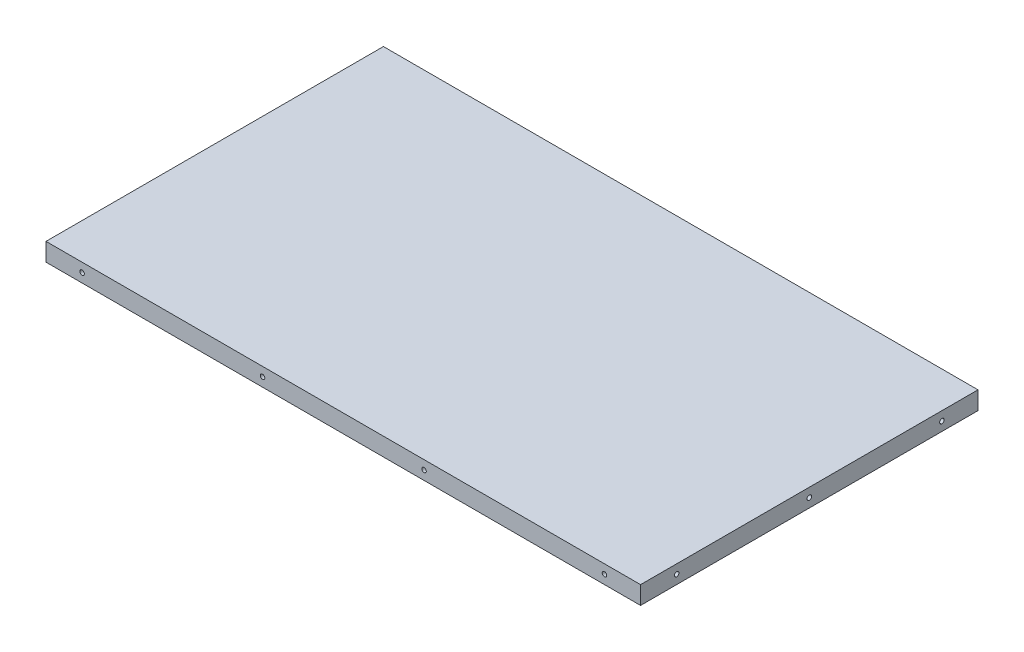
ISO-10303-21;
HEADER;
FILE_DESCRIPTION(('STEP AP214'),'2;1');
FILE_NAME('part.step','',(''),(''),'','','');
FILE_SCHEMA(('AUTOMOTIVE_DESIGN { 1 0 10303 214 1 1 1 1 }'));
ENDSEC;
DATA;
#1=APPLICATION_CONTEXT('core data for automotive mechanical design processes');
#2=APPLICATION_PROTOCOL_DEFINITION('international standard','automotive_design',2000,#1);
#3=PRODUCT_CONTEXT('',#1,'mechanical');
#4=PRODUCT('Part','Part','',(#3));
#5=PRODUCT_RELATED_PRODUCT_CATEGORY('part','',(#4));
#6=PRODUCT_DEFINITION_FORMATION('','',#4);
#7=PRODUCT_DEFINITION_CONTEXT('part definition',#1,'design');
#8=PRODUCT_DEFINITION('design','',#6,#7);
#9=PRODUCT_DEFINITION_SHAPE('','',#8);
#10=(LENGTH_UNIT() NAMED_UNIT(*) SI_UNIT(.MILLI.,.METRE.));
#11=(NAMED_UNIT(*) PLANE_ANGLE_UNIT() SI_UNIT($,.RADIAN.));
#12=(NAMED_UNIT(*) SI_UNIT($,.STERADIAN.) SOLID_ANGLE_UNIT());
#13=UNCERTAINTY_MEASURE_WITH_UNIT(LENGTH_MEASURE(1.E-05),#10,'distance_accuracy_value','');
#14=(GEOMETRIC_REPRESENTATION_CONTEXT(3) GLOBAL_UNCERTAINTY_ASSIGNED_CONTEXT((#13)) GLOBAL_UNIT_ASSIGNED_CONTEXT((#10,
#11,#12)) REPRESENTATION_CONTEXT('',''));
#15=CARTESIAN_POINT('',(0.,0.,0.));
#16=DIRECTION('',(0.,0.,1.));
#17=DIRECTION('',(1.,0.,0.));
#18=AXIS2_PLACEMENT_3D('',#15,#16,#17);
#19=CARTESIAN_POINT('',(0.,10.,0.));
#20=DIRECTION('',(1.,0.,0.));
#21=DIRECTION('',(0.,0.,-1.));
#22=AXIS2_PLACEMENT_3D('',#19,#20,#21);
#23=PLANE('',#22);
#24=CARTESIAN_POINT('',(0.,5.,-20.));
#25=DIRECTION('',(-1.,0.,0.));
#26=DIRECTION('',(0.,0.,1.));
#27=AXIS2_PLACEMENT_3D('',#24,#25,#26);
#28=CIRCLE('',#27,1.25);
#29=CARTESIAN_POINT('',(0.,5.,-18.75));
#30=VERTEX_POINT('',#29);
#31=EDGE_CURVE('E169',#30,#30,#28,.T.);
#32=ORIENTED_EDGE('',*,*,#31,.F.);
#33=EDGE_LOOP('',(#32));
#34=FACE_BOUND('',#33,.T.);
#35=CARTESIAN_POINT('',(0.,5.,-93.5));
#36=DIRECTION('',(-1.,0.,0.));
#37=DIRECTION('',(0.,0.,1.));
#38=AXIS2_PLACEMENT_3D('',#35,#36,#37);
#39=CIRCLE('',#38,1.25);
#40=CARTESIAN_POINT('',(0.,5.,-92.25));
#41=VERTEX_POINT('',#40);
#42=EDGE_CURVE('E163',#41,#41,#39,.T.);
#43=ORIENTED_EDGE('',*,*,#42,.F.);
#44=EDGE_LOOP('',(#43));
#45=FACE_BOUND('',#44,.T.);
#46=CARTESIAN_POINT('',(0.,5.,-167.));
#47=DIRECTION('',(-1.,0.,0.));
#48=DIRECTION('',(0.,0.,1.));
#49=AXIS2_PLACEMENT_3D('',#46,#47,#48);
#50=CIRCLE('',#49,1.25000000000001);
#51=CARTESIAN_POINT('',(0.,5.,-165.75));
#52=VERTEX_POINT('',#51);
#53=EDGE_CURVE('E157',#52,#52,#50,.T.);
#54=ORIENTED_EDGE('',*,*,#53,.F.);
#55=EDGE_LOOP('',(#54));
#56=FACE_BOUND('',#55,.T.);
#57=DIRECTION('',(0.,0.,1.));
#58=VECTOR('',#57,1.);
#59=CARTESIAN_POINT('',(0.,0.,0.));
#60=LINE('',#59,#58);
#61=CARTESIAN_POINT('',(0.,0.,-187.));
#62=VERTEX_POINT('',#61);
#63=CARTESIAN_POINT('',(0.,0.,0.));
#64=VERTEX_POINT('',#63);
#65=EDGE_CURVE('E95',#62,#64,#60,.T.);
#66=ORIENTED_EDGE('',*,*,#65,.T.);
#67=DIRECTION('',(0.,-1.,0.));
#68=VECTOR('',#67,1.);
#69=CARTESIAN_POINT('',(0.,10.,0.));
#70=LINE('',#69,#68);
#71=CARTESIAN_POINT('',(0.,10.,0.));
#72=VERTEX_POINT('',#71);
#73=EDGE_CURVE('E11',#72,#64,#70,.T.);
#74=ORIENTED_EDGE('',*,*,#73,.F.);
#75=DIRECTION('',(0.,0.,1.));
#76=VECTOR('',#75,1.);
#77=CARTESIAN_POINT('',(0.,10.,0.));
#78=LINE('',#77,#76);
#79=CARTESIAN_POINT('',(0.,10.,-187.));
#80=VERTEX_POINT('',#79);
#81=EDGE_CURVE('E83',#80,#72,#78,.T.);
#82=ORIENTED_EDGE('',*,*,#81,.F.);
#83=DIRECTION('',(0.,-1.,0.));
#84=VECTOR('',#83,1.);
#85=CARTESIAN_POINT('',(0.,10.,-187.));
#86=LINE('',#85,#84);
#87=EDGE_CURVE('E91',#80,#62,#86,.T.);
#88=ORIENTED_EDGE('',*,*,#87,.T.);
#89=EDGE_LOOP('',(#66,#74,#82,#88));
#90=FACE_BOUND('',#89,.T.);
#91=ADVANCED_FACE('F32',(#34,#45,#56,#90),#23,.F.);
#92=CARTESIAN_POINT('',(0.,10.,0.));
#93=DIRECTION('',(0.,0.,-1.));
#94=DIRECTION('',(-1.,0.,0.));
#95=AXIS2_PLACEMENT_3D('',#92,#93,#94);
#96=PLANE('',#95);
#97=CARTESIAN_POINT('',(309.5,5.,0.));
#98=DIRECTION('',(0.,0.,1.));
#99=DIRECTION('',(1.,0.,0.));
#100=AXIS2_PLACEMENT_3D('',#97,#98,#99);
#101=CIRCLE('',#100,1.24999999999996);
#102=CARTESIAN_POINT('',(310.75,5.,0.));
#103=VERTEX_POINT('',#102);
#104=EDGE_CURVE('E127',#103,#103,#101,.T.);
#105=ORIENTED_EDGE('',*,*,#104,.F.);
#106=EDGE_LOOP('',(#105));
#107=FACE_BOUND('',#106,.T.);
#108=CARTESIAN_POINT('',(209.5,5.,0.));
#109=DIRECTION('',(0.,0.,1.));
#110=DIRECTION('',(1.,0.,0.));
#111=AXIS2_PLACEMENT_3D('',#108,#109,#110);
#112=CIRCLE('',#111,1.25000000000001);
#113=CARTESIAN_POINT('',(210.75,5.,0.));
#114=VERTEX_POINT('',#113);
#115=EDGE_CURVE('E121',#114,#114,#112,.T.);
#116=ORIENTED_EDGE('',*,*,#115,.F.);
#117=EDGE_LOOP('',(#116));
#118=FACE_BOUND('',#117,.T.);
#119=CARTESIAN_POINT('',(120.,5.,0.));
#120=DIRECTION('',(0.,0.,1.));
#121=DIRECTION('',(1.,0.,0.));
#122=AXIS2_PLACEMENT_3D('',#119,#120,#121);
#123=CIRCLE('',#122,1.25);
#124=CARTESIAN_POINT('',(121.25,5.,0.));
#125=VERTEX_POINT('',#124);
#126=EDGE_CURVE('E115',#125,#125,#123,.T.);
#127=ORIENTED_EDGE('',*,*,#126,.F.);
#128=EDGE_LOOP('',(#127));
#129=FACE_BOUND('',#128,.T.);
#130=CARTESIAN_POINT('',(20.,5.,0.));
#131=DIRECTION('',(0.,0.,1.));
#132=DIRECTION('',(1.,0.,0.));
#133=AXIS2_PLACEMENT_3D('',#130,#131,#132);
#134=CIRCLE('',#133,1.25);
#135=CARTESIAN_POINT('',(21.25,5.,0.));
#136=VERTEX_POINT('',#135);
#137=EDGE_CURVE('E109',#136,#136,#134,.T.);
#138=ORIENTED_EDGE('',*,*,#137,.F.);
#139=EDGE_LOOP('',(#138));
#140=FACE_BOUND('',#139,.T.);
#141=DIRECTION('',(1.,0.,0.));
#142=VECTOR('',#141,1.);
#143=CARTESIAN_POINT('',(0.,0.,0.));
#144=LINE('',#143,#142);
#145=CARTESIAN_POINT('',(329.5,0.,0.));
#146=VERTEX_POINT('',#145);
#147=EDGE_CURVE('E87',#64,#146,#144,.T.);
#148=ORIENTED_EDGE('',*,*,#147,.T.);
#149=DIRECTION('',(0.,-1.,0.));
#150=VECTOR('',#149,1.);
#151=CARTESIAN_POINT('',(329.5,10.,0.));
#152=LINE('',#151,#150);
#153=CARTESIAN_POINT('',(329.5,10.,0.));
#154=VERTEX_POINT('',#153);
#155=EDGE_CURVE('E40',#154,#146,#152,.T.);
#156=ORIENTED_EDGE('',*,*,#155,.F.);
#157=DIRECTION('',(1.,0.,0.));
#158=VECTOR('',#157,1.);
#159=CARTESIAN_POINT('',(0.,10.,0.));
#160=LINE('',#159,#158);
#161=EDGE_CURVE('E78',#72,#154,#160,.T.);
#162=ORIENTED_EDGE('',*,*,#161,.F.);
#163=ORIENTED_EDGE('',*,*,#73,.T.);
#164=EDGE_LOOP('',(#148,#156,#162,#163));
#165=FACE_BOUND('',#164,.T.);
#166=ADVANCED_FACE('F86',(#107,#118,#129,#140,#165),#96,.F.);
#167=CARTESIAN_POINT('',(329.5,10.,0.));
#168=DIRECTION('',(-1.,0.,0.));
#169=DIRECTION('',(0.,0.,1.));
#170=AXIS2_PLACEMENT_3D('',#167,#168,#169);
#171=PLANE('',#170);
#172=CARTESIAN_POINT('',(329.5,5.,-20.));
#173=DIRECTION('',(-1.,0.,0.));
#174=DIRECTION('',(0.,0.,1.));
#175=AXIS2_PLACEMENT_3D('',#172,#173,#174);
#176=CIRCLE('',#175,1.25);
#177=CARTESIAN_POINT('',(329.5,5.,-18.75));
#178=VERTEX_POINT('',#177);
#179=EDGE_CURVE('E187',#178,#178,#176,.T.);
#180=ORIENTED_EDGE('',*,*,#179,.T.);
#181=EDGE_LOOP('',(#180));
#182=FACE_BOUND('',#181,.T.);
#183=CARTESIAN_POINT('',(329.5,5.,-93.5));
#184=DIRECTION('',(-1.,0.,0.));
#185=DIRECTION('',(0.,0.,1.));
#186=AXIS2_PLACEMENT_3D('',#183,#184,#185);
#187=CIRCLE('',#186,1.25);
#188=CARTESIAN_POINT('',(329.5,5.,-92.25));
#189=VERTEX_POINT('',#188);
#190=EDGE_CURVE('E181',#189,#189,#187,.T.);
#191=ORIENTED_EDGE('',*,*,#190,.T.);
#192=EDGE_LOOP('',(#191));
#193=FACE_BOUND('',#192,.T.);
#194=CARTESIAN_POINT('',(329.5,5.,-167.));
#195=DIRECTION('',(-1.,0.,0.));
#196=DIRECTION('',(0.,0.,1.));
#197=AXIS2_PLACEMENT_3D('',#194,#195,#196);
#198=CIRCLE('',#197,1.25000000000001);
#199=CARTESIAN_POINT('',(329.5,5.,-165.75));
#200=VERTEX_POINT('',#199);
#201=EDGE_CURVE('E175',#200,#200,#198,.T.);
#202=ORIENTED_EDGE('',*,*,#201,.T.);
#203=EDGE_LOOP('',(#202));
#204=FACE_BOUND('',#203,.T.);
#205=DIRECTION('',(0.,0.,-1.));
#206=VECTOR('',#205,1.);
#207=CARTESIAN_POINT('',(329.5,0.,0.));
#208=LINE('',#207,#206);
#209=CARTESIAN_POINT('',(329.5,0.,-187.));
#210=VERTEX_POINT('',#209);
#211=EDGE_CURVE('E65',#146,#210,#208,.T.);
#212=ORIENTED_EDGE('',*,*,#211,.T.);
#213=DIRECTION('',(0.,-1.,0.));
#214=VECTOR('',#213,1.);
#215=CARTESIAN_POINT('',(329.5,10.,-187.));
#216=LINE('',#215,#214);
#217=CARTESIAN_POINT('',(329.5,10.,-187.));
#218=VERTEX_POINT('',#217);
#219=EDGE_CURVE('E88',#218,#210,#216,.T.);
#220=ORIENTED_EDGE('',*,*,#219,.F.);
#221=DIRECTION('',(0.,0.,-1.));
#222=VECTOR('',#221,1.);
#223=CARTESIAN_POINT('',(329.5,10.,0.));
#224=LINE('',#223,#222);
#225=EDGE_CURVE('E81',#154,#218,#224,.T.);
#226=ORIENTED_EDGE('',*,*,#225,.F.);
#227=ORIENTED_EDGE('',*,*,#155,.T.);
#228=EDGE_LOOP('',(#212,#220,#226,#227));
#229=FACE_BOUND('',#228,.T.);
#230=ADVANCED_FACE('F89',(#182,#193,#204,#229),#171,.F.);
#231=CARTESIAN_POINT('',(0.,10.,-187.));
#232=DIRECTION('',(0.,0.,1.));
#233=DIRECTION('',(1.,0.,0.));
#234=AXIS2_PLACEMENT_3D('',#231,#232,#233);
#235=PLANE('',#234);
#236=CARTESIAN_POINT('',(309.5,5.,-187.));
#237=DIRECTION('',(0.,0.,1.));
#238=DIRECTION('',(1.,0.,0.));
#239=AXIS2_PLACEMENT_3D('',#236,#237,#238);
#240=CIRCLE('',#239,1.24999999999996);
#241=CARTESIAN_POINT('',(310.75,5.,-187.));
#242=VERTEX_POINT('',#241);
#243=EDGE_CURVE('E151',#242,#242,#240,.T.);
#244=ORIENTED_EDGE('',*,*,#243,.T.);
#245=EDGE_LOOP('',(#244));
#246=FACE_BOUND('',#245,.T.);
#247=CARTESIAN_POINT('',(209.5,5.,-187.));
#248=DIRECTION('',(0.,0.,1.));
#249=DIRECTION('',(1.,0.,0.));
#250=AXIS2_PLACEMENT_3D('',#247,#248,#249);
#251=CIRCLE('',#250,1.25000000000001);
#252=CARTESIAN_POINT('',(210.75,5.,-187.));
#253=VERTEX_POINT('',#252);
#254=EDGE_CURVE('E145',#253,#253,#251,.T.);
#255=ORIENTED_EDGE('',*,*,#254,.T.);
#256=EDGE_LOOP('',(#255));
#257=FACE_BOUND('',#256,.T.);
#258=CARTESIAN_POINT('',(120.,5.,-187.));
#259=DIRECTION('',(0.,0.,1.));
#260=DIRECTION('',(1.,0.,0.));
#261=AXIS2_PLACEMENT_3D('',#258,#259,#260);
#262=CIRCLE('',#261,1.25);
#263=CARTESIAN_POINT('',(121.25,5.,-187.));
#264=VERTEX_POINT('',#263);
#265=EDGE_CURVE('E139',#264,#264,#262,.T.);
#266=ORIENTED_EDGE('',*,*,#265,.T.);
#267=EDGE_LOOP('',(#266));
#268=FACE_BOUND('',#267,.T.);
#269=CARTESIAN_POINT('',(20.,5.,-187.));
#270=DIRECTION('',(0.,0.,1.));
#271=DIRECTION('',(1.,0.,0.));
#272=AXIS2_PLACEMENT_3D('',#269,#270,#271);
#273=CIRCLE('',#272,1.25);
#274=CARTESIAN_POINT('',(21.25,5.,-187.));
#275=VERTEX_POINT('',#274);
#276=EDGE_CURVE('E133',#275,#275,#273,.T.);
#277=ORIENTED_EDGE('',*,*,#276,.T.);
#278=EDGE_LOOP('',(#277));
#279=FACE_BOUND('',#278,.T.);
#280=DIRECTION('',(-1.,0.,0.));
#281=VECTOR('',#280,1.);
#282=CARTESIAN_POINT('',(0.,0.,-187.));
#283=LINE('',#282,#281);
#284=EDGE_CURVE('E71',#210,#62,#283,.T.);
#285=ORIENTED_EDGE('',*,*,#284,.T.);
#286=ORIENTED_EDGE('',*,*,#87,.F.);
#287=DIRECTION('',(-1.,0.,0.));
#288=VECTOR('',#287,1.);
#289=CARTESIAN_POINT('',(0.,10.,-187.));
#290=LINE('',#289,#288);
#291=EDGE_CURVE('E48',#218,#80,#290,.T.);
#292=ORIENTED_EDGE('',*,*,#291,.F.);
#293=ORIENTED_EDGE('',*,*,#219,.T.);
#294=EDGE_LOOP('',(#285,#286,#292,#293));
#295=FACE_BOUND('',#294,.T.);
#296=ADVANCED_FACE('F103',(#246,#257,#268,#279,#295),#235,.F.);
#297=CARTESIAN_POINT('',(0.,10.,0.));
#298=DIRECTION('',(0.,-1.,0.));
#299=DIRECTION('',(0.,0.,-1.));
#300=AXIS2_PLACEMENT_3D('',#297,#298,#299);
#301=PLANE('',#300);
#302=ORIENTED_EDGE('',*,*,#81,.T.);
#303=ORIENTED_EDGE('',*,*,#161,.T.);
#304=ORIENTED_EDGE('',*,*,#225,.T.);
#305=ORIENTED_EDGE('',*,*,#291,.T.);
#306=EDGE_LOOP('',(#302,#303,#304,#305));
#307=FACE_BOUND('',#306,.T.);
#308=ADVANCED_FACE('F79',(#307),#301,.F.);
#309=CARTESIAN_POINT('',(0.,0.,0.));
#310=DIRECTION('',(0.,-1.,0.));
#311=DIRECTION('',(0.,0.,-1.));
#312=AXIS2_PLACEMENT_3D('',#309,#310,#311);
#313=PLANE('',#312);
#314=ORIENTED_EDGE('',*,*,#65,.F.);
#315=ORIENTED_EDGE('',*,*,#284,.F.);
#316=ORIENTED_EDGE('',*,*,#211,.F.);
#317=ORIENTED_EDGE('',*,*,#147,.F.);
#318=EDGE_LOOP('',(#314,#315,#316,#317));
#319=FACE_BOUND('',#318,.T.);
#320=ADVANCED_FACE('F106',(#319),#313,.T.);
#321=CARTESIAN_POINT('',(20.,5.,-10.));
#322=DIRECTION('',(0.,0.,1.));
#323=DIRECTION('',(1.,0.,0.));
#324=AXIS2_PLACEMENT_3D('',#321,#322,#323);
#325=CYLINDRICAL_SURFACE('',#324,1.25);
#326=CARTESIAN_POINT('',(20.,5.,-10.));
#327=DIRECTION('',(0.,0.,1.));
#328=DIRECTION('',(1.,0.,0.));
#329=AXIS2_PLACEMENT_3D('',#326,#327,#328);
#330=CIRCLE('',#329,1.25);
#331=CARTESIAN_POINT('',(21.25,5.,-10.));
#332=VERTEX_POINT('',#331);
#333=EDGE_CURVE('E98',#332,#332,#330,.T.);
#334=ORIENTED_EDGE('',*,*,#333,.F.);
#335=EDGE_LOOP('',(#334));
#336=FACE_BOUND('',#335,.T.);
#337=ORIENTED_EDGE('',*,*,#137,.T.);
#338=EDGE_LOOP('',(#337));
#339=FACE_BOUND('',#338,.T.);
#340=ADVANCED_FACE('F289',(#336,#339),#325,.F.);
#341=CARTESIAN_POINT('',(20.,5.,-10.));
#342=DIRECTION('',(0.,0.,1.));
#343=DIRECTION('',(1.,0.,0.));
#344=AXIS2_PLACEMENT_3D('',#341,#342,#343);
#345=PLANE('',#344);
#346=ORIENTED_EDGE('',*,*,#333,.T.);
#347=EDGE_LOOP('',(#346));
#348=FACE_BOUND('',#347,.T.);
#349=ADVANCED_FACE('F285',(#348),#345,.T.);
#350=CARTESIAN_POINT('',(120.,5.,-10.));
#351=DIRECTION('',(0.,0.,1.));
#352=DIRECTION('',(1.,0.,0.));
#353=AXIS2_PLACEMENT_3D('',#350,#351,#352);
#354=CYLINDRICAL_SURFACE('',#353,1.25);
#355=CARTESIAN_POINT('',(120.,5.,-10.));
#356=DIRECTION('',(0.,0.,1.));
#357=DIRECTION('',(1.,0.,0.));
#358=AXIS2_PLACEMENT_3D('',#355,#356,#357);
#359=CIRCLE('',#358,1.25);
#360=CARTESIAN_POINT('',(121.25,5.,-10.));
#361=VERTEX_POINT('',#360);
#362=EDGE_CURVE('E112',#361,#361,#359,.T.);
#363=ORIENTED_EDGE('',*,*,#362,.F.);
#364=EDGE_LOOP('',(#363));
#365=FACE_BOUND('',#364,.T.);
#366=ORIENTED_EDGE('',*,*,#126,.T.);
#367=EDGE_LOOP('',(#366));
#368=FACE_BOUND('',#367,.T.);
#369=ADVANCED_FACE('F281',(#365,#368),#354,.F.);
#370=CARTESIAN_POINT('',(120.,5.,-10.));
#371=DIRECTION('',(0.,0.,1.));
#372=DIRECTION('',(1.,0.,0.));
#373=AXIS2_PLACEMENT_3D('',#370,#371,#372);
#374=PLANE('',#373);
#375=ORIENTED_EDGE('',*,*,#362,.T.);
#376=EDGE_LOOP('',(#375));
#377=FACE_BOUND('',#376,.T.);
#378=ADVANCED_FACE('F277',(#377),#374,.T.);
#379=CARTESIAN_POINT('',(209.5,5.,-10.));
#380=DIRECTION('',(0.,0.,1.));
#381=DIRECTION('',(1.,0.,0.));
#382=AXIS2_PLACEMENT_3D('',#379,#380,#381);
#383=CYLINDRICAL_SURFACE('',#382,1.25000000000001);
#384=CARTESIAN_POINT('',(209.5,5.,-10.));
#385=DIRECTION('',(0.,0.,1.));
#386=DIRECTION('',(1.,0.,0.));
#387=AXIS2_PLACEMENT_3D('',#384,#385,#386);
#388=CIRCLE('',#387,1.25000000000001);
#389=CARTESIAN_POINT('',(210.75,5.,-10.));
#390=VERTEX_POINT('',#389);
#391=EDGE_CURVE('E118',#390,#390,#388,.T.);
#392=ORIENTED_EDGE('',*,*,#391,.F.);
#393=EDGE_LOOP('',(#392));
#394=FACE_BOUND('',#393,.T.);
#395=ORIENTED_EDGE('',*,*,#115,.T.);
#396=EDGE_LOOP('',(#395));
#397=FACE_BOUND('',#396,.T.);
#398=ADVANCED_FACE('F273',(#394,#397),#383,.F.);
#399=CARTESIAN_POINT('',(209.5,5.,-10.));
#400=DIRECTION('',(0.,0.,1.));
#401=DIRECTION('',(1.,0.,0.));
#402=AXIS2_PLACEMENT_3D('',#399,#400,#401);
#403=PLANE('',#402);
#404=ORIENTED_EDGE('',*,*,#391,.T.);
#405=EDGE_LOOP('',(#404));
#406=FACE_BOUND('',#405,.T.);
#407=ADVANCED_FACE('F269',(#406),#403,.T.);
#408=CARTESIAN_POINT('',(309.5,5.,-10.));
#409=DIRECTION('',(0.,0.,1.));
#410=DIRECTION('',(1.,0.,0.));
#411=AXIS2_PLACEMENT_3D('',#408,#409,#410);
#412=CYLINDRICAL_SURFACE('',#411,1.24999999999996);
#413=CARTESIAN_POINT('',(309.5,5.,-10.));
#414=DIRECTION('',(0.,0.,1.));
#415=DIRECTION('',(1.,0.,0.));
#416=AXIS2_PLACEMENT_3D('',#413,#414,#415);
#417=CIRCLE('',#416,1.24999999999996);
#418=CARTESIAN_POINT('',(310.75,5.,-10.));
#419=VERTEX_POINT('',#418);
#420=EDGE_CURVE('E124',#419,#419,#417,.T.);
#421=ORIENTED_EDGE('',*,*,#420,.F.);
#422=EDGE_LOOP('',(#421));
#423=FACE_BOUND('',#422,.T.);
#424=ORIENTED_EDGE('',*,*,#104,.T.);
#425=EDGE_LOOP('',(#424));
#426=FACE_BOUND('',#425,.T.);
#427=ADVANCED_FACE('F265',(#423,#426),#412,.F.);
#428=CARTESIAN_POINT('',(309.5,5.,-10.));
#429=DIRECTION('',(0.,0.,1.));
#430=DIRECTION('',(1.,0.,0.));
#431=AXIS2_PLACEMENT_3D('',#428,#429,#430);
#432=PLANE('',#431);
#433=ORIENTED_EDGE('',*,*,#420,.T.);
#434=EDGE_LOOP('',(#433));
#435=FACE_BOUND('',#434,.T.);
#436=ADVANCED_FACE('F261',(#435),#432,.T.);
#437=CARTESIAN_POINT('',(20.,5.,-177.));
#438=DIRECTION('',(0.,0.,-1.));
#439=DIRECTION('',(-1.,0.,0.));
#440=AXIS2_PLACEMENT_3D('',#437,#438,#439);
#441=CYLINDRICAL_SURFACE('',#440,1.25);
#442=CARTESIAN_POINT('',(20.,5.,-177.));
#443=DIRECTION('',(0.,0.,1.));
#444=DIRECTION('',(1.,0.,0.));
#445=AXIS2_PLACEMENT_3D('',#442,#443,#444);
#446=CIRCLE('',#445,1.25);
#447=CARTESIAN_POINT('',(21.25,5.,-177.));
#448=VERTEX_POINT('',#447);
#449=EDGE_CURVE('E130',#448,#448,#446,.T.);
#450=ORIENTED_EDGE('',*,*,#449,.T.);
#451=EDGE_LOOP('',(#450));
#452=FACE_BOUND('',#451,.T.);
#453=ORIENTED_EDGE('',*,*,#276,.F.);
#454=EDGE_LOOP('',(#453));
#455=FACE_BOUND('',#454,.T.);
#456=ADVANCED_FACE('F257',(#452,#455),#441,.F.);
#457=CARTESIAN_POINT('',(20.,5.,-177.));
#458=DIRECTION('',(0.,0.,1.));
#459=DIRECTION('',(1.,0.,0.));
#460=AXIS2_PLACEMENT_3D('',#457,#458,#459);
#461=PLANE('',#460);
#462=ORIENTED_EDGE('',*,*,#449,.F.);
#463=EDGE_LOOP('',(#462));
#464=FACE_BOUND('',#463,.T.);
#465=ADVANCED_FACE('F253',(#464),#461,.F.);
#466=CARTESIAN_POINT('',(120.,5.,-177.));
#467=DIRECTION('',(0.,0.,-1.));
#468=DIRECTION('',(-1.,0.,0.));
#469=AXIS2_PLACEMENT_3D('',#466,#467,#468);
#470=CYLINDRICAL_SURFACE('',#469,1.25);
#471=CARTESIAN_POINT('',(120.,5.,-177.));
#472=DIRECTION('',(0.,0.,1.));
#473=DIRECTION('',(1.,0.,0.));
#474=AXIS2_PLACEMENT_3D('',#471,#472,#473);
#475=CIRCLE('',#474,1.25);
#476=CARTESIAN_POINT('',(121.25,5.,-177.));
#477=VERTEX_POINT('',#476);
#478=EDGE_CURVE('E136',#477,#477,#475,.T.);
#479=ORIENTED_EDGE('',*,*,#478,.T.);
#480=EDGE_LOOP('',(#479));
#481=FACE_BOUND('',#480,.T.);
#482=ORIENTED_EDGE('',*,*,#265,.F.);
#483=EDGE_LOOP('',(#482));
#484=FACE_BOUND('',#483,.T.);
#485=ADVANCED_FACE('F249',(#481,#484),#470,.F.);
#486=CARTESIAN_POINT('',(120.,5.,-177.));
#487=DIRECTION('',(0.,0.,1.));
#488=DIRECTION('',(1.,0.,0.));
#489=AXIS2_PLACEMENT_3D('',#486,#487,#488);
#490=PLANE('',#489);
#491=ORIENTED_EDGE('',*,*,#478,.F.);
#492=EDGE_LOOP('',(#491));
#493=FACE_BOUND('',#492,.T.);
#494=ADVANCED_FACE('F245',(#493),#490,.F.);
#495=CARTESIAN_POINT('',(209.5,5.,-177.));
#496=DIRECTION('',(0.,0.,-1.));
#497=DIRECTION('',(-1.,0.,0.));
#498=AXIS2_PLACEMENT_3D('',#495,#496,#497);
#499=CYLINDRICAL_SURFACE('',#498,1.25000000000001);
#500=CARTESIAN_POINT('',(209.5,5.,-177.));
#501=DIRECTION('',(0.,0.,1.));
#502=DIRECTION('',(1.,0.,0.));
#503=AXIS2_PLACEMENT_3D('',#500,#501,#502);
#504=CIRCLE('',#503,1.25000000000001);
#505=CARTESIAN_POINT('',(210.75,5.,-177.));
#506=VERTEX_POINT('',#505);
#507=EDGE_CURVE('E142',#506,#506,#504,.T.);
#508=ORIENTED_EDGE('',*,*,#507,.T.);
#509=EDGE_LOOP('',(#508));
#510=FACE_BOUND('',#509,.T.);
#511=ORIENTED_EDGE('',*,*,#254,.F.);
#512=EDGE_LOOP('',(#511));
#513=FACE_BOUND('',#512,.T.);
#514=ADVANCED_FACE('F241',(#510,#513),#499,.F.);
#515=CARTESIAN_POINT('',(209.5,5.,-177.));
#516=DIRECTION('',(0.,0.,1.));
#517=DIRECTION('',(1.,0.,0.));
#518=AXIS2_PLACEMENT_3D('',#515,#516,#517);
#519=PLANE('',#518);
#520=ORIENTED_EDGE('',*,*,#507,.F.);
#521=EDGE_LOOP('',(#520));
#522=FACE_BOUND('',#521,.T.);
#523=ADVANCED_FACE('F237',(#522),#519,.F.);
#524=CARTESIAN_POINT('',(309.5,5.,-177.));
#525=DIRECTION('',(0.,0.,-1.));
#526=DIRECTION('',(-1.,0.,0.));
#527=AXIS2_PLACEMENT_3D('',#524,#525,#526);
#528=CYLINDRICAL_SURFACE('',#527,1.24999999999996);
#529=CARTESIAN_POINT('',(309.5,5.,-177.));
#530=DIRECTION('',(0.,0.,1.));
#531=DIRECTION('',(1.,0.,0.));
#532=AXIS2_PLACEMENT_3D('',#529,#530,#531);
#533=CIRCLE('',#532,1.24999999999996);
#534=CARTESIAN_POINT('',(310.75,5.,-177.));
#535=VERTEX_POINT('',#534);
#536=EDGE_CURVE('E148',#535,#535,#533,.T.);
#537=ORIENTED_EDGE('',*,*,#536,.T.);
#538=EDGE_LOOP('',(#537));
#539=FACE_BOUND('',#538,.T.);
#540=ORIENTED_EDGE('',*,*,#243,.F.);
#541=EDGE_LOOP('',(#540));
#542=FACE_BOUND('',#541,.T.);
#543=ADVANCED_FACE('F229',(#539,#542),#528,.F.);
#544=CARTESIAN_POINT('',(309.5,5.,-177.));
#545=DIRECTION('',(0.,0.,1.));
#546=DIRECTION('',(1.,0.,0.));
#547=AXIS2_PLACEMENT_3D('',#544,#545,#546);
#548=PLANE('',#547);
#549=ORIENTED_EDGE('',*,*,#536,.F.);
#550=EDGE_LOOP('',(#549));
#551=FACE_BOUND('',#550,.T.);
#552=ADVANCED_FACE('F219',(#551),#548,.F.);
#553=CARTESIAN_POINT('',(10.,5.,-167.));
#554=DIRECTION('',(-1.,0.,0.));
#555=DIRECTION('',(0.,0.,1.));
#556=AXIS2_PLACEMENT_3D('',#553,#554,#555);
#557=CYLINDRICAL_SURFACE('',#556,1.25000000000001);
#558=CARTESIAN_POINT('',(10.,5.,-167.));
#559=DIRECTION('',(-1.,0.,0.));
#560=DIRECTION('',(0.,0.,1.));
#561=AXIS2_PLACEMENT_3D('',#558,#559,#560);
#562=CIRCLE('',#561,1.25000000000001);
#563=CARTESIAN_POINT('',(10.,5.,-165.75));
#564=VERTEX_POINT('',#563);
#565=EDGE_CURVE('E154',#564,#564,#562,.T.);
#566=ORIENTED_EDGE('',*,*,#565,.F.);
#567=EDGE_LOOP('',(#566));
#568=FACE_BOUND('',#567,.T.);
#569=ORIENTED_EDGE('',*,*,#53,.T.);
#570=EDGE_LOOP('',(#569));
#571=FACE_BOUND('',#570,.T.);
#572=ADVANCED_FACE('F216',(#568,#571),#557,.F.);
#573=CARTESIAN_POINT('',(10.,5.,-167.));
#574=DIRECTION('',(-1.,0.,0.));
#575=DIRECTION('',(0.,0.,1.));
#576=AXIS2_PLACEMENT_3D('',#573,#574,#575);
#577=PLANE('',#576);
#578=ORIENTED_EDGE('',*,*,#565,.T.);
#579=EDGE_LOOP('',(#578));
#580=FACE_BOUND('',#579,.T.);
#581=ADVANCED_FACE('F218',(#580),#577,.T.);
#582=CARTESIAN_POINT('',(10.,5.,-93.5));
#583=DIRECTION('',(-1.,0.,0.));
#584=DIRECTION('',(0.,0.,1.));
#585=AXIS2_PLACEMENT_3D('',#582,#583,#584);
#586=CYLINDRICAL_SURFACE('',#585,1.25);
#587=CARTESIAN_POINT('',(10.,5.,-93.5));
#588=DIRECTION('',(-1.,0.,0.));
#589=DIRECTION('',(0.,0.,1.));
#590=AXIS2_PLACEMENT_3D('',#587,#588,#589);
#591=CIRCLE('',#590,1.25);
#592=CARTESIAN_POINT('',(10.,5.,-92.25));
#593=VERTEX_POINT('',#592);
#594=EDGE_CURVE('E160',#593,#593,#591,.T.);
#595=ORIENTED_EDGE('',*,*,#594,.F.);
#596=EDGE_LOOP('',(#595));
#597=FACE_BOUND('',#596,.T.);
#598=ORIENTED_EDGE('',*,*,#42,.T.);
#599=EDGE_LOOP('',(#598));
#600=FACE_BOUND('',#599,.T.);
#601=ADVANCED_FACE('F226',(#597,#600),#586,.F.);
#602=CARTESIAN_POINT('',(10.,5.,-93.5));
#603=DIRECTION('',(-1.,0.,0.));
#604=DIRECTION('',(0.,0.,1.));
#605=AXIS2_PLACEMENT_3D('',#602,#603,#604);
#606=PLANE('',#605);
#607=ORIENTED_EDGE('',*,*,#594,.T.);
#608=EDGE_LOOP('',(#607));
#609=FACE_BOUND('',#608,.T.);
#610=ADVANCED_FACE('F331',(#609),#606,.T.);
#611=CARTESIAN_POINT('',(10.,5.,-20.));
#612=DIRECTION('',(-1.,0.,0.));
#613=DIRECTION('',(0.,0.,1.));
#614=AXIS2_PLACEMENT_3D('',#611,#612,#613);
#615=CYLINDRICAL_SURFACE('',#614,1.25);
#616=CARTESIAN_POINT('',(10.,5.,-20.));
#617=DIRECTION('',(-1.,0.,0.));
#618=DIRECTION('',(0.,0.,1.));
#619=AXIS2_PLACEMENT_3D('',#616,#617,#618);
#620=CIRCLE('',#619,1.25);
#621=CARTESIAN_POINT('',(10.,5.,-18.75));
#622=VERTEX_POINT('',#621);
#623=EDGE_CURVE('E166',#622,#622,#620,.T.);
#624=ORIENTED_EDGE('',*,*,#623,.F.);
#625=EDGE_LOOP('',(#624));
#626=FACE_BOUND('',#625,.T.);
#627=ORIENTED_EDGE('',*,*,#31,.T.);
#628=EDGE_LOOP('',(#627));
#629=FACE_BOUND('',#628,.T.);
#630=ADVANCED_FACE('F324',(#626,#629),#615,.F.);
#631=CARTESIAN_POINT('',(10.,5.,-20.));
#632=DIRECTION('',(-1.,0.,0.));
#633=DIRECTION('',(0.,0.,1.));
#634=AXIS2_PLACEMENT_3D('',#631,#632,#633);
#635=PLANE('',#634);
#636=ORIENTED_EDGE('',*,*,#623,.T.);
#637=EDGE_LOOP('',(#636));
#638=FACE_BOUND('',#637,.T.);
#639=ADVANCED_FACE('F314',(#638),#635,.T.);
#640=CARTESIAN_POINT('',(319.5,5.,-167.));
#641=DIRECTION('',(1.,0.,0.));
#642=DIRECTION('',(0.,0.,-1.));
#643=AXIS2_PLACEMENT_3D('',#640,#641,#642);
#644=CYLINDRICAL_SURFACE('',#643,1.25000000000001);
#645=CARTESIAN_POINT('',(319.5,5.,-167.));
#646=DIRECTION('',(-1.,0.,0.));
#647=DIRECTION('',(0.,0.,1.));
#648=AXIS2_PLACEMENT_3D('',#645,#646,#647);
#649=CIRCLE('',#648,1.25000000000001);
#650=CARTESIAN_POINT('',(319.5,5.,-165.75));
#651=VERTEX_POINT('',#650);
#652=EDGE_CURVE('E172',#651,#651,#649,.T.);
#653=ORIENTED_EDGE('',*,*,#652,.T.);
#654=EDGE_LOOP('',(#653));
#655=FACE_BOUND('',#654,.T.);
#656=ORIENTED_EDGE('',*,*,#201,.F.);
#657=EDGE_LOOP('',(#656));
#658=FACE_BOUND('',#657,.T.);
#659=ADVANCED_FACE('F311',(#655,#658),#644,.F.);
#660=CARTESIAN_POINT('',(319.5,5.,-167.));
#661=DIRECTION('',(-1.,0.,0.));
#662=DIRECTION('',(0.,0.,1.));
#663=AXIS2_PLACEMENT_3D('',#660,#661,#662);
#664=PLANE('',#663);
#665=ORIENTED_EDGE('',*,*,#652,.F.);
#666=EDGE_LOOP('',(#665));
#667=FACE_BOUND('',#666,.T.);
#668=ADVANCED_FACE('F313',(#667),#664,.F.);
#669=CARTESIAN_POINT('',(319.5,5.,-93.5));
#670=DIRECTION('',(1.,0.,0.));
#671=DIRECTION('',(0.,0.,-1.));
#672=AXIS2_PLACEMENT_3D('',#669,#670,#671);
#673=CYLINDRICAL_SURFACE('',#672,1.25);
#674=CARTESIAN_POINT('',(319.5,5.,-93.5));
#675=DIRECTION('',(-1.,0.,0.));
#676=DIRECTION('',(0.,0.,1.));
#677=AXIS2_PLACEMENT_3D('',#674,#675,#676);
#678=CIRCLE('',#677,1.25);
#679=CARTESIAN_POINT('',(319.5,5.,-92.25));
#680=VERTEX_POINT('',#679);
#681=EDGE_CURVE('E178',#680,#680,#678,.T.);
#682=ORIENTED_EDGE('',*,*,#681,.T.);
#683=EDGE_LOOP('',(#682));
#684=FACE_BOUND('',#683,.T.);
#685=ORIENTED_EDGE('',*,*,#190,.F.);
#686=EDGE_LOOP('',(#685));
#687=FACE_BOUND('',#686,.T.);
#688=ADVANCED_FACE('F321',(#684,#687),#673,.F.);
#689=CARTESIAN_POINT('',(319.5,5.,-93.5));
#690=DIRECTION('',(-1.,0.,0.));
#691=DIRECTION('',(0.,0.,1.));
#692=AXIS2_PLACEMENT_3D('',#689,#690,#691);
#693=PLANE('',#692);
#694=ORIENTED_EDGE('',*,*,#681,.F.);
#695=EDGE_LOOP('',(#694));
#696=FACE_BOUND('',#695,.T.);
#697=ADVANCED_FACE('F202',(#696),#693,.F.);
#698=CARTESIAN_POINT('',(319.5,5.,-20.));
#699=DIRECTION('',(1.,0.,0.));
#700=DIRECTION('',(0.,0.,-1.));
#701=AXIS2_PLACEMENT_3D('',#698,#699,#700);
#702=CYLINDRICAL_SURFACE('',#701,1.25);
#703=CARTESIAN_POINT('',(319.5,5.,-20.));
#704=DIRECTION('',(-1.,0.,0.));
#705=DIRECTION('',(0.,0.,1.));
#706=AXIS2_PLACEMENT_3D('',#703,#704,#705);
#707=CIRCLE('',#706,1.25);
#708=CARTESIAN_POINT('',(319.5,5.,-18.75));
#709=VERTEX_POINT('',#708);
#710=EDGE_CURVE('E184',#709,#709,#707,.T.);
#711=ORIENTED_EDGE('',*,*,#710,.T.);
#712=EDGE_LOOP('',(#711));
#713=FACE_BOUND('',#712,.T.);
#714=ORIENTED_EDGE('',*,*,#179,.F.);
#715=EDGE_LOOP('',(#714));
#716=FACE_BOUND('',#715,.T.);
#717=ADVANCED_FACE('F193',(#713,#716),#702,.F.);
#718=CARTESIAN_POINT('',(319.5,5.,-20.));
#719=DIRECTION('',(-1.,0.,0.));
#720=DIRECTION('',(0.,0.,1.));
#721=AXIS2_PLACEMENT_3D('',#718,#719,#720);
#722=PLANE('',#721);
#723=ORIENTED_EDGE('',*,*,#710,.F.);
#724=EDGE_LOOP('',(#723));
#725=FACE_BOUND('',#724,.T.);
#726=ADVANCED_FACE('F196',(#725),#722,.F.);
#727=CLOSED_SHELL('',(#91,#166,#230,#296,#308,#320,#340,#349,#369,#378,#398,#407,#427,#436,#456,
#465,#485,#494,#514,#523,#543,#552,#572,#581,#601,#610,#630,#639,#659,#668,#688,#697,#717,#726));
#728=MANIFOLD_SOLID_BREP('B2',#727);
#729=ADVANCED_BREP_SHAPE_REPRESENTATION('',(#18,#728),#14);
#730=SHAPE_DEFINITION_REPRESENTATION(#9,#729);
ENDSEC;
END-ISO-10303-21;
